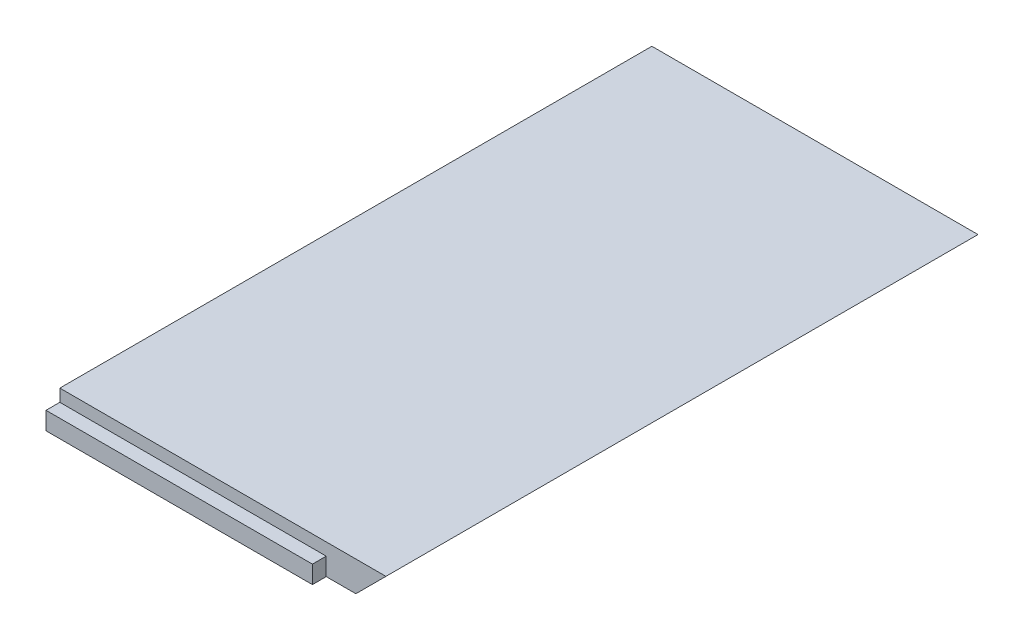
ISO-10303-21;
HEADER;
FILE_DESCRIPTION(('STEP AP214'),'2;1');
FILE_NAME('part.step','',(''),(''),'','','');
FILE_SCHEMA(('AUTOMOTIVE_DESIGN { 1 0 10303 214 1 1 1 1 }'));
ENDSEC;
DATA;
#1=APPLICATION_CONTEXT('core data for automotive mechanical design processes');
#2=APPLICATION_PROTOCOL_DEFINITION('international standard','automotive_design',2000,#1);
#3=PRODUCT_CONTEXT('',#1,'mechanical');
#4=PRODUCT('Part','Part','',(#3));
#5=PRODUCT_RELATED_PRODUCT_CATEGORY('part','',(#4));
#6=PRODUCT_DEFINITION_FORMATION('','',#4);
#7=PRODUCT_DEFINITION_CONTEXT('part definition',#1,'design');
#8=PRODUCT_DEFINITION('design','',#6,#7);
#9=PRODUCT_DEFINITION_SHAPE('','',#8);
#10=(LENGTH_UNIT() NAMED_UNIT(*) SI_UNIT(.MILLI.,.METRE.));
#11=(NAMED_UNIT(*) PLANE_ANGLE_UNIT() SI_UNIT($,.RADIAN.));
#12=(NAMED_UNIT(*) SI_UNIT($,.STERADIAN.) SOLID_ANGLE_UNIT());
#13=UNCERTAINTY_MEASURE_WITH_UNIT(LENGTH_MEASURE(1.E-05),#10,'distance_accuracy_value','');
#14=(GEOMETRIC_REPRESENTATION_CONTEXT(3) GLOBAL_UNCERTAINTY_ASSIGNED_CONTEXT((#13)) GLOBAL_UNIT_ASSIGNED_CONTEXT((#10,
#11,#12)) REPRESENTATION_CONTEXT('',''));
#15=CARTESIAN_POINT('',(0.,0.,0.));
#16=DIRECTION('',(0.,0.,1.));
#17=DIRECTION('',(1.,0.,0.));
#18=AXIS2_PLACEMENT_3D('',#15,#16,#17);
#19=CARTESIAN_POINT('',(-300.,185.313864628821,307.001));
#20=DIRECTION('',(0.707106781186551,-0.707106781186544,0.));
#21=DIRECTION('',(0.707106781186544,0.707106781186551,0.));
#22=AXIS2_PLACEMENT_3D('',#19,#20,#21);
#23=PLANE('',#22);
#24=DIRECTION('',(-0.707106781186544,-0.707106781186551,0.));
#25=VECTOR('',#24,1.);
#26=CARTESIAN_POINT('',(-300.,185.313864628821,300.));
#27=LINE('',#26,#25);
#28=CARTESIAN_POINT('',(-300.,185.313864628821,300.));
#29=VERTEX_POINT('',#28);
#30=CARTESIAN_POINT('',(-315.25,170.063864628821,300.));
#31=VERTEX_POINT('',#30);
#32=EDGE_CURVE('E52',#29,#31,#27,.T.);
#33=ORIENTED_EDGE('',*,*,#32,.T.);
#34=DIRECTION('',(0.,0.,-1.));
#35=VECTOR('',#34,1.);
#36=CARTESIAN_POINT('',(-315.25,170.063864628821,307.001));
#37=LINE('',#36,#35);
#38=CARTESIAN_POINT('',(-315.25,170.063864628821,0.));
#39=VERTEX_POINT('',#38);
#40=EDGE_CURVE('E150',#31,#39,#37,.T.);
#41=ORIENTED_EDGE('',*,*,#40,.T.);
#42=DIRECTION('',(-0.707106781186544,-0.707106781186551,0.));
#43=VECTOR('',#42,1.);
#44=CARTESIAN_POINT('',(-300.,185.313864628821,0.));
#45=LINE('',#44,#43);
#46=CARTESIAN_POINT('',(-300.,185.313864628821,0.));
#47=VERTEX_POINT('',#46);
#48=EDGE_CURVE('E149',#47,#39,#45,.T.);
#49=ORIENTED_EDGE('',*,*,#48,.F.);
#50=DIRECTION('',(0.,0.,-1.));
#51=VECTOR('',#50,1.);
#52=CARTESIAN_POINT('',(-300.,185.313864628821,465.952176846223));
#53=LINE('',#52,#51);
#54=EDGE_CURVE('E132',#29,#47,#53,.T.);
#55=ORIENTED_EDGE('',*,*,#54,.F.);
#56=EDGE_LOOP('',(#33,#41,#49,#55));
#57=FACE_BOUND('',#56,.T.);
#58=ADVANCED_FACE('F35',(#57),#23,.T.);
#59=CARTESIAN_POINT('',(-300.,170.063864628821,465.952176846223));
#60=DIRECTION('',(0.,1.,0.));
#61=DIRECTION('',(-1.,0.,0.));
#62=AXIS2_PLACEMENT_3D('',#59,#60,#61);
#63=PLANE('',#62);
#64=DIRECTION('',(-1.,0.,0.));
#65=VECTOR('',#64,1.);
#66=CARTESIAN_POINT('',(-330.25,170.063864628821,300.));
#67=LINE('',#66,#65);
#68=CARTESIAN_POINT('',(-330.25,170.063864628821,300.));
#69=VERTEX_POINT('',#68);
#70=EDGE_CURVE('E110',#31,#69,#67,.T.);
#71=ORIENTED_EDGE('',*,*,#70,.T.);
#72=DIRECTION('',(0.,0.,1.));
#73=VECTOR('',#72,1.);
#74=CARTESIAN_POINT('',(-330.25,170.063864628821,274.367988764047));
#75=LINE('',#74,#73);
#76=CARTESIAN_POINT('',(-330.25,170.063864628821,307.));
#77=VERTEX_POINT('',#76);
#78=EDGE_CURVE('E99',#69,#77,#75,.T.);
#79=ORIENTED_EDGE('',*,*,#78,.T.);
#80=DIRECTION('',(-1.,0.,0.));
#81=VECTOR('',#80,1.);
#82=CARTESIAN_POINT('',(-288.598245749009,170.063864628821,307.));
#83=LINE('',#82,#81);
#84=CARTESIAN_POINT('',(-465.25,170.063864628821,307.));
#85=VERTEX_POINT('',#84);
#86=EDGE_CURVE('E108',#77,#85,#83,.T.);
#87=ORIENTED_EDGE('',*,*,#86,.T.);
#88=DIRECTION('',(0.,0.,-1.));
#89=VECTOR('',#88,1.);
#90=CARTESIAN_POINT('',(-465.25,170.063864628821,465.952176846223));
#91=LINE('',#90,#89);
#92=CARTESIAN_POINT('',(-465.25,170.063864628821,0.));
#93=VERTEX_POINT('',#92);
#94=EDGE_CURVE('E39',#85,#93,#91,.T.);
#95=ORIENTED_EDGE('',*,*,#94,.T.);
#96=DIRECTION('',(1.,0.,0.));
#97=VECTOR('',#96,1.);
#98=CARTESIAN_POINT('',(-300.,170.063864628821,0.));
#99=LINE('',#98,#97);
#100=EDGE_CURVE('E125',#93,#39,#99,.T.);
#101=ORIENTED_EDGE('',*,*,#100,.T.);
#102=ORIENTED_EDGE('',*,*,#40,.F.);
#103=EDGE_LOOP('',(#71,#79,#87,#95,#101,#102));
#104=FACE_BOUND('',#103,.T.);
#105=ADVANCED_FACE('F107',(#104),#63,.F.);
#106=CARTESIAN_POINT('',(0.,0.,0.));
#107=DIRECTION('',(0.,0.,-1.));
#108=DIRECTION('',(-1.,0.,0.));
#109=AXIS2_PLACEMENT_3D('',#106,#107,#108);
#110=PLANE('',#109);
#111=DIRECTION('',(-1.,0.,0.));
#112=VECTOR('',#111,1.);
#113=CARTESIAN_POINT('',(-300.,185.313864628821,0.));
#114=LINE('',#113,#112);
#115=CARTESIAN_POINT('',(-465.25,185.313864628821,0.));
#116=VERTEX_POINT('',#115);
#117=EDGE_CURVE('E130',#47,#116,#114,.T.);
#118=ORIENTED_EDGE('',*,*,#117,.F.);
#119=ORIENTED_EDGE('',*,*,#48,.T.);
#120=ORIENTED_EDGE('',*,*,#100,.F.);
#121=DIRECTION('',(0.,-1.,0.));
#122=VECTOR('',#121,1.);
#123=CARTESIAN_POINT('',(-465.25,185.313864628821,0.));
#124=LINE('',#123,#122);
#125=EDGE_CURVE('E127',#116,#93,#124,.T.);
#126=ORIENTED_EDGE('',*,*,#125,.F.);
#127=EDGE_LOOP('',(#118,#119,#120,#126));
#128=FACE_BOUND('',#127,.T.);
#129=ADVANCED_FACE('F148',(#128),#110,.T.);
#130=CARTESIAN_POINT('',(-465.25,185.313864628821,300.));
#131=DIRECTION('',(0.,0.,1.));
#132=DIRECTION('',(0.,1.,0.));
#133=AXIS2_PLACEMENT_3D('',#130,#131,#132);
#134=PLANE('',#133);
#135=DIRECTION('',(-1.,0.,0.));
#136=VECTOR('',#135,1.);
#137=CARTESIAN_POINT('',(-288.598245749009,179.063864628821,300.));
#138=LINE('',#137,#136);
#139=CARTESIAN_POINT('',(-330.25,179.063864628821,300.));
#140=VERTEX_POINT('',#139);
#141=CARTESIAN_POINT('',(-465.25,179.063864628821,300.));
#142=VERTEX_POINT('',#141);
#143=EDGE_CURVE('E119',#140,#142,#138,.T.);
#144=ORIENTED_EDGE('',*,*,#143,.F.);
#145=DIRECTION('',(0.,1.,0.));
#146=VECTOR('',#145,1.);
#147=CARTESIAN_POINT('',(-330.25,179.063864628821,300.));
#148=LINE('',#147,#146);
#149=EDGE_CURVE('E160',#69,#140,#148,.T.);
#150=ORIENTED_EDGE('',*,*,#149,.F.);
#151=ORIENTED_EDGE('',*,*,#70,.F.);
#152=ORIENTED_EDGE('',*,*,#32,.F.);
#153=DIRECTION('',(-1.,0.,0.));
#154=VECTOR('',#153,1.);
#155=CARTESIAN_POINT('',(-300.,185.313864628821,300.));
#156=LINE('',#155,#154);
#157=CARTESIAN_POINT('',(-465.25,185.313864628821,300.));
#158=VERTEX_POINT('',#157);
#159=EDGE_CURVE('E44',#29,#158,#156,.T.);
#160=ORIENTED_EDGE('',*,*,#159,.T.);
#161=DIRECTION('',(0.,-1.,0.));
#162=VECTOR('',#161,1.);
#163=CARTESIAN_POINT('',(-465.25,185.313864628821,300.));
#164=LINE('',#163,#162);
#165=EDGE_CURVE('E12',#158,#142,#164,.T.);
#166=ORIENTED_EDGE('',*,*,#165,.T.);
#167=EDGE_LOOP('',(#144,#150,#151,#152,#160,#166));
#168=FACE_BOUND('',#167,.T.);
#169=ADVANCED_FACE('F37',(#168),#134,.T.);
#170=CARTESIAN_POINT('',(-288.598245749009,179.063864628821,300.));
#171=DIRECTION('',(0.,1.,0.));
#172=DIRECTION('',(0.,0.,1.));
#173=AXIS2_PLACEMENT_3D('',#170,#171,#172);
#174=PLANE('',#173);
#175=DIRECTION('',(0.,0.,1.));
#176=VECTOR('',#175,1.);
#177=CARTESIAN_POINT('',(-330.25,179.063864628821,274.367988764047));
#178=LINE('',#177,#176);
#179=CARTESIAN_POINT('',(-330.25,179.063864628821,307.));
#180=VERTEX_POINT('',#179);
#181=EDGE_CURVE('E102',#140,#180,#178,.T.);
#182=ORIENTED_EDGE('',*,*,#181,.F.);
#183=ORIENTED_EDGE('',*,*,#143,.T.);
#184=DIRECTION('',(0.,0.,-1.));
#185=VECTOR('',#184,1.);
#186=CARTESIAN_POINT('',(-465.25,179.063864628821,300.));
#187=LINE('',#186,#185);
#188=CARTESIAN_POINT('',(-465.25,179.063864628821,307.));
#189=VERTEX_POINT('',#188);
#190=EDGE_CURVE('E117',#189,#142,#187,.T.);
#191=ORIENTED_EDGE('',*,*,#190,.F.);
#192=DIRECTION('',(-1.,0.,0.));
#193=VECTOR('',#192,1.);
#194=CARTESIAN_POINT('',(-288.598245749009,179.063864628821,307.));
#195=LINE('',#194,#193);
#196=EDGE_CURVE('E116',#180,#189,#195,.T.);
#197=ORIENTED_EDGE('',*,*,#196,.F.);
#198=EDGE_LOOP('',(#182,#183,#191,#197));
#199=FACE_BOUND('',#198,.T.);
#200=ADVANCED_FACE('F158',(#199),#174,.T.);
#201=CARTESIAN_POINT('',(-288.598245749009,179.063864628821,307.));
#202=DIRECTION('',(0.,0.,1.));
#203=DIRECTION('',(1.,0.,0.));
#204=AXIS2_PLACEMENT_3D('',#201,#202,#203);
#205=PLANE('',#204);
#206=DIRECTION('',(0.,-1.,0.));
#207=VECTOR('',#206,1.);
#208=CARTESIAN_POINT('',(-330.25,179.063864628821,307.));
#209=LINE('',#208,#207);
#210=EDGE_CURVE('E96',#180,#77,#209,.T.);
#211=ORIENTED_EDGE('',*,*,#210,.F.);
#212=ORIENTED_EDGE('',*,*,#196,.T.);
#213=DIRECTION('',(0.,1.,0.));
#214=VECTOR('',#213,1.);
#215=CARTESIAN_POINT('',(-465.25,179.063864628821,307.));
#216=LINE('',#215,#214);
#217=EDGE_CURVE('E115',#85,#189,#216,.T.);
#218=ORIENTED_EDGE('',*,*,#217,.F.);
#219=ORIENTED_EDGE('',*,*,#86,.F.);
#220=EDGE_LOOP('',(#211,#212,#218,#219));
#221=FACE_BOUND('',#220,.T.);
#222=ADVANCED_FACE('F113',(#221),#205,.T.);
#223=CARTESIAN_POINT('',(-300.,185.313864628821,465.952176846223));
#224=DIRECTION('',(0.,-1.,0.));
#225=DIRECTION('',(0.,0.,-1.));
#226=AXIS2_PLACEMENT_3D('',#223,#224,#225);
#227=PLANE('',#226);
#228=ORIENTED_EDGE('',*,*,#159,.F.);
#229=ORIENTED_EDGE('',*,*,#54,.T.);
#230=ORIENTED_EDGE('',*,*,#117,.T.);
#231=DIRECTION('',(0.,0.,-1.));
#232=VECTOR('',#231,1.);
#233=CARTESIAN_POINT('',(-465.25,185.313864628821,465.952176846223));
#234=LINE('',#233,#232);
#235=EDGE_CURVE('E129',#158,#116,#234,.T.);
#236=ORIENTED_EDGE('',*,*,#235,.F.);
#237=EDGE_LOOP('',(#228,#229,#230,#236));
#238=FACE_BOUND('',#237,.T.);
#239=ADVANCED_FACE('F145',(#238),#227,.F.);
#240=CARTESIAN_POINT('',(-465.25,185.313864628821,465.952176846223));
#241=DIRECTION('',(1.,0.,0.));
#242=DIRECTION('',(0.,0.,-1.));
#243=AXIS2_PLACEMENT_3D('',#240,#241,#242);
#244=PLANE('',#243);
#245=ORIENTED_EDGE('',*,*,#165,.F.);
#246=ORIENTED_EDGE('',*,*,#235,.T.);
#247=ORIENTED_EDGE('',*,*,#125,.T.);
#248=ORIENTED_EDGE('',*,*,#94,.F.);
#249=ORIENTED_EDGE('',*,*,#217,.T.);
#250=ORIENTED_EDGE('',*,*,#190,.T.);
#251=EDGE_LOOP('',(#245,#246,#247,#248,#249,#250));
#252=FACE_BOUND('',#251,.T.);
#253=ADVANCED_FACE('F139',(#252),#244,.F.);
#254=CARTESIAN_POINT('',(-330.25,179.063864628821,274.367988764047));
#255=DIRECTION('',(-1.,0.,0.));
#256=DIRECTION('',(0.,0.,1.));
#257=AXIS2_PLACEMENT_3D('',#254,#255,#256);
#258=PLANE('',#257);
#259=ORIENTED_EDGE('',*,*,#149,.T.);
#260=ORIENTED_EDGE('',*,*,#181,.T.);
#261=ORIENTED_EDGE('',*,*,#210,.T.);
#262=ORIENTED_EDGE('',*,*,#78,.F.);
#263=EDGE_LOOP('',(#259,#260,#261,#262));
#264=FACE_BOUND('',#263,.T.);
#265=ADVANCED_FACE('F98',(#264),#258,.F.);
#266=CLOSED_SHELL('',(#58,#105,#129,#169,#200,#222,#239,#253,#265));
#267=MANIFOLD_SOLID_BREP('B2',#266);
#268=ADVANCED_BREP_SHAPE_REPRESENTATION('',(#18,#267),#14);
#269=SHAPE_DEFINITION_REPRESENTATION(#9,#268);
ENDSEC;
END-ISO-10303-21;
